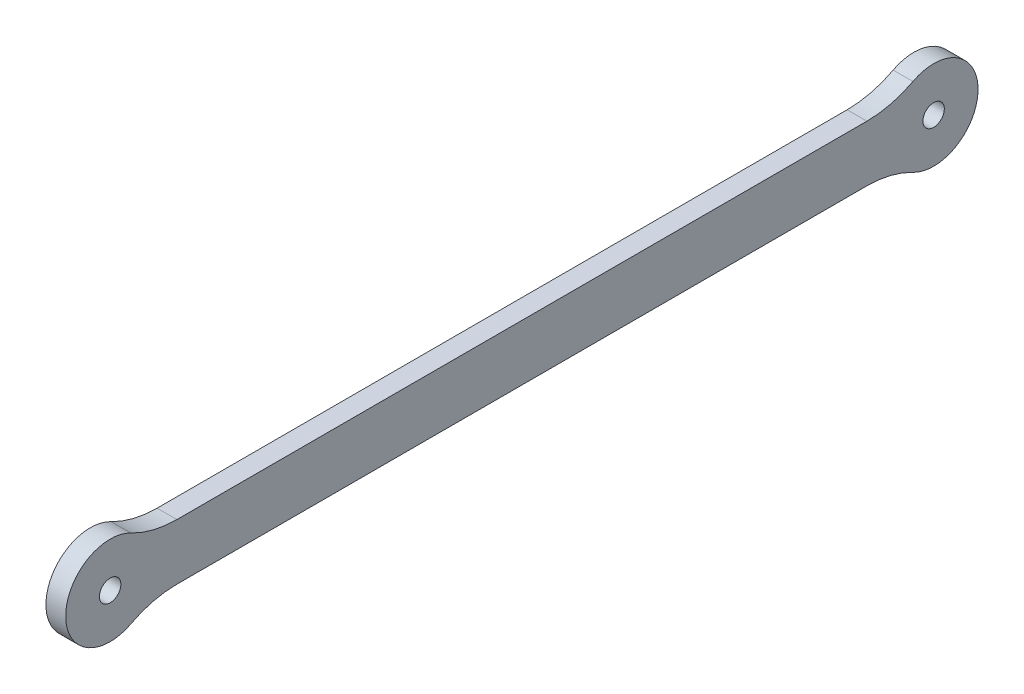
ISO-10303-21;
HEADER;
FILE_DESCRIPTION(('STEP AP214'),'2;1');
FILE_NAME('part.step','',(''),(''),'','','');
FILE_SCHEMA(('AUTOMOTIVE_DESIGN { 1 0 10303 214 1 1 1 1 }'));
ENDSEC;
DATA;
#1=APPLICATION_CONTEXT('core data for automotive mechanical design processes');
#2=APPLICATION_PROTOCOL_DEFINITION('international standard','automotive_design',2000,#1);
#3=PRODUCT_CONTEXT('',#1,'mechanical');
#4=PRODUCT('Part','Part','',(#3));
#5=PRODUCT_RELATED_PRODUCT_CATEGORY('part','',(#4));
#6=PRODUCT_DEFINITION_FORMATION('','',#4);
#7=PRODUCT_DEFINITION_CONTEXT('part definition',#1,'design');
#8=PRODUCT_DEFINITION('design','',#6,#7);
#9=PRODUCT_DEFINITION_SHAPE('','',#8);
#10=(LENGTH_UNIT() NAMED_UNIT(*) SI_UNIT(.MILLI.,.METRE.));
#11=(NAMED_UNIT(*) PLANE_ANGLE_UNIT() SI_UNIT($,.RADIAN.));
#12=(NAMED_UNIT(*) SI_UNIT($,.STERADIAN.) SOLID_ANGLE_UNIT());
#13=UNCERTAINTY_MEASURE_WITH_UNIT(LENGTH_MEASURE(1.E-05),#10,'distance_accuracy_value','');
#14=(GEOMETRIC_REPRESENTATION_CONTEXT(3) GLOBAL_UNCERTAINTY_ASSIGNED_CONTEXT((#13)) GLOBAL_UNIT_ASSIGNED_CONTEXT((#10,
#11,#12)) REPRESENTATION_CONTEXT('',''));
#15=CARTESIAN_POINT('',(0.,0.,0.));
#16=DIRECTION('',(0.,0.,1.));
#17=DIRECTION('',(1.,0.,0.));
#18=AXIS2_PLACEMENT_3D('',#15,#16,#17);
#19=CARTESIAN_POINT('',(-1.5,0.,0.));
#20=DIRECTION('',(1.,0.,0.));
#21=DIRECTION('',(0.,0.,-1.));
#22=AXIS2_PLACEMENT_3D('',#19,#20,#21);
#23=PLANE('',#22);
#24=CARTESIAN_POINT('',(-1.5,0.,-62.5));
#25=DIRECTION('',(-1.,0.,0.));
#26=DIRECTION('',(0.,0.,1.));
#27=AXIS2_PLACEMENT_3D('',#24,#25,#26);
#28=CIRCLE('',#27,1.62500000000001);
#29=CARTESIAN_POINT('',(-1.5,0.,-60.875));
#30=VERTEX_POINT('',#29);
#31=EDGE_CURVE('E140',#30,#30,#28,.F.);
#32=ORIENTED_EDGE('',*,*,#31,.T.);
#33=EDGE_LOOP('',(#32));
#34=FACE_BOUND('',#33,.T.);
#35=CARTESIAN_POINT('',(-1.5,0.,62.5));
#36=DIRECTION('',(-1.,0.,0.));
#37=DIRECTION('',(0.,0.,1.));
#38=AXIS2_PLACEMENT_3D('',#35,#36,#37);
#39=CIRCLE('',#38,1.62500000000001);
#40=CARTESIAN_POINT('',(-1.5,0.,64.125));
#41=VERTEX_POINT('',#40);
#42=EDGE_CURVE('E98',#41,#41,#39,.F.);
#43=ORIENTED_EDGE('',*,*,#42,.T.);
#44=EDGE_LOOP('',(#43));
#45=FACE_BOUND('',#44,.T.);
#46=CARTESIAN_POINT('',(-1.5,19.25,-52.3757716343417));
#47=DIRECTION('',(-1.,0.,0.));
#48=DIRECTION('',(0.,0.,1.));
#49=AXIS2_PLACEMENT_3D('',#46,#47,#48);
#50=CIRCLE('',#49,15.);
#51=CARTESIAN_POINT('',(-1.5,4.25000000000001,-52.3757716343417));
#52=VERTEX_POINT('',#51);
#53=CARTESIAN_POINT('',(-1.5,5.97413793103448,-59.3579980934164));
#54=VERTEX_POINT('',#53);
#55=EDGE_CURVE('E84',#52,#54,#50,.F.);
#56=ORIENTED_EDGE('',*,*,#55,.T.);
#57=CARTESIAN_POINT('',(-1.5,0.,-62.5));
#58=DIRECTION('',(-1.,0.,0.));
#59=DIRECTION('',(0.,0.,1.));
#60=AXIS2_PLACEMENT_3D('',#57,#58,#59);
#61=CIRCLE('',#60,6.74999999999999);
#62=CARTESIAN_POINT('',(-1.5,-5.97413793103448,-59.3579980934164));
#63=VERTEX_POINT('',#62);
#64=EDGE_CURVE('E20',#63,#54,#61,.F.);
#65=ORIENTED_EDGE('',*,*,#64,.F.);
#66=CARTESIAN_POINT('',(-1.5,-19.25,-52.3757716343417));
#67=DIRECTION('',(-1.,0.,0.));
#68=DIRECTION('',(0.,0.,1.));
#69=AXIS2_PLACEMENT_3D('',#66,#67,#68);
#70=CIRCLE('',#69,15.);
#71=CARTESIAN_POINT('',(-1.5,-4.25,-52.3757716343417));
#72=VERTEX_POINT('',#71);
#73=EDGE_CURVE('E82',#63,#72,#70,.F.);
#74=ORIENTED_EDGE('',*,*,#73,.T.);
#75=DIRECTION('',(0.,0.,-1.));
#76=VECTOR('',#75,1.);
#77=CARTESIAN_POINT('',(-1.5,-4.25,0.));
#78=LINE('',#77,#76);
#79=CARTESIAN_POINT('',(-1.5,-4.25000000000001,52.3757716343417));
#80=VERTEX_POINT('',#79);
#81=EDGE_CURVE('E121',#80,#72,#78,.T.);
#82=ORIENTED_EDGE('',*,*,#81,.F.);
#83=CARTESIAN_POINT('',(-1.5,-19.25,52.3757716343417));
#84=DIRECTION('',(-1.,0.,0.));
#85=DIRECTION('',(0.,0.,1.));
#86=AXIS2_PLACEMENT_3D('',#83,#84,#85);
#87=CIRCLE('',#86,15.);
#88=CARTESIAN_POINT('',(-1.5,-5.9741379310345,59.3579980934164));
#89=VERTEX_POINT('',#88);
#90=EDGE_CURVE('E103',#80,#89,#87,.F.);
#91=ORIENTED_EDGE('',*,*,#90,.T.);
#92=CARTESIAN_POINT('',(-1.5,0.,62.5));
#93=DIRECTION('',(-1.,0.,0.));
#94=DIRECTION('',(0.,0.,1.));
#95=AXIS2_PLACEMENT_3D('',#92,#93,#94);
#96=CIRCLE('',#95,6.75);
#97=CARTESIAN_POINT('',(-1.5,5.97413793103448,59.3579980934164));
#98=VERTEX_POINT('',#97);
#99=EDGE_CURVE('E106',#98,#89,#96,.F.);
#100=ORIENTED_EDGE('',*,*,#99,.F.);
#101=CARTESIAN_POINT('',(-1.5,19.25,52.3757716343417));
#102=DIRECTION('',(-1.,0.,0.));
#103=DIRECTION('',(0.,0.,1.));
#104=AXIS2_PLACEMENT_3D('',#101,#102,#103);
#105=CIRCLE('',#104,15.);
#106=CARTESIAN_POINT('',(-1.5,4.25,52.3757716343417));
#107=VERTEX_POINT('',#106);
#108=EDGE_CURVE('E110',#98,#107,#105,.F.);
#109=ORIENTED_EDGE('',*,*,#108,.T.);
#110=DIRECTION('',(0.,0.,-1.));
#111=VECTOR('',#110,1.);
#112=CARTESIAN_POINT('',(-1.5,4.25,0.));
#113=LINE('',#112,#111);
#114=EDGE_CURVE('E114',#107,#52,#113,.T.);
#115=ORIENTED_EDGE('',*,*,#114,.T.);
#116=EDGE_LOOP('',(#56,#65,#74,#82,#91,#100,#109,#115));
#117=FACE_BOUND('',#116,.T.);
#118=ADVANCED_FACE('F17',(#34,#45,#117),#23,.F.);
#119=CARTESIAN_POINT('',(1.5,0.,-62.5));
#120=DIRECTION('',(-1.,0.,0.));
#121=DIRECTION('',(0.,0.,1.));
#122=AXIS2_PLACEMENT_3D('',#119,#120,#121);
#123=CYLINDRICAL_SURFACE('',#122,6.74999999999999);
#124=CARTESIAN_POINT('',(1.5,0.,-62.5));
#125=DIRECTION('',(-1.,0.,0.));
#126=DIRECTION('',(0.,0.,1.));
#127=AXIS2_PLACEMENT_3D('',#124,#125,#126);
#128=CIRCLE('',#127,6.74999999999999);
#129=CARTESIAN_POINT('',(1.5,-5.97413793103448,-59.3579980934164));
#130=VERTEX_POINT('',#129);
#131=CARTESIAN_POINT('',(1.5,5.97413793103448,-59.3579980934164));
#132=VERTEX_POINT('',#131);
#133=EDGE_CURVE('E91',#130,#132,#128,.F.);
#134=ORIENTED_EDGE('',*,*,#133,.F.);
#135=DIRECTION('',(-1.,0.,0.));
#136=VECTOR('',#135,1.);
#137=CARTESIAN_POINT('',(1.5,-5.97413793103448,-59.3579980934164));
#138=LINE('',#137,#136);
#139=EDGE_CURVE('E88',#130,#63,#138,.T.);
#140=ORIENTED_EDGE('',*,*,#139,.T.);
#141=ORIENTED_EDGE('',*,*,#64,.T.);
#142=DIRECTION('',(-1.,0.,0.));
#143=VECTOR('',#142,1.);
#144=CARTESIAN_POINT('',(1.5,5.97413793103448,-59.3579980934164));
#145=LINE('',#144,#143);
#146=EDGE_CURVE('E113',#54,#132,#145,.F.);
#147=ORIENTED_EDGE('',*,*,#146,.T.);
#148=EDGE_LOOP('',(#134,#140,#141,#147));
#149=FACE_BOUND('',#148,.T.);
#150=ADVANCED_FACE('F89',(#149),#123,.T.);
#151=CARTESIAN_POINT('',(1.5,19.25,-52.3757716343417));
#152=DIRECTION('',(-1.,0.,0.));
#153=DIRECTION('',(0.,0.,1.));
#154=AXIS2_PLACEMENT_3D('',#151,#152,#153);
#155=CYLINDRICAL_SURFACE('',#154,15.);
#156=ORIENTED_EDGE('',*,*,#146,.F.);
#157=ORIENTED_EDGE('',*,*,#55,.F.);
#158=DIRECTION('',(1.,0.,0.));
#159=VECTOR('',#158,1.);
#160=CARTESIAN_POINT('',(1.5,4.25000000000001,-52.3757716343417));
#161=LINE('',#160,#159);
#162=CARTESIAN_POINT('',(1.5,4.25000000000001,-52.3757716343417));
#163=VERTEX_POINT('',#162);
#164=EDGE_CURVE('E112',#52,#163,#161,.T.);
#165=ORIENTED_EDGE('',*,*,#164,.T.);
#166=CARTESIAN_POINT('',(1.5,19.25,-52.3757716343417));
#167=DIRECTION('',(-1.,0.,0.));
#168=DIRECTION('',(0.,0.,1.));
#169=AXIS2_PLACEMENT_3D('',#166,#167,#168);
#170=CIRCLE('',#169,15.);
#171=EDGE_CURVE('E137',#132,#163,#170,.T.);
#172=ORIENTED_EDGE('',*,*,#171,.F.);
#173=EDGE_LOOP('',(#156,#157,#165,#172));
#174=FACE_BOUND('',#173,.T.);
#175=ADVANCED_FACE('F195',(#174),#155,.F.);
#176=CARTESIAN_POINT('',(1.5,4.25,0.));
#177=DIRECTION('',(0.,-1.,0.));
#178=DIRECTION('',(0.,0.,-1.));
#179=AXIS2_PLACEMENT_3D('',#176,#177,#178);
#180=PLANE('',#179);
#181=ORIENTED_EDGE('',*,*,#164,.F.);
#182=ORIENTED_EDGE('',*,*,#114,.F.);
#183=DIRECTION('',(-1.,0.,0.));
#184=VECTOR('',#183,1.);
#185=CARTESIAN_POINT('',(1.5,4.25,52.3757716343417));
#186=LINE('',#185,#184);
#187=CARTESIAN_POINT('',(1.5,4.25,52.3757716343417));
#188=VERTEX_POINT('',#187);
#189=EDGE_CURVE('E111',#107,#188,#186,.F.);
#190=ORIENTED_EDGE('',*,*,#189,.T.);
#191=DIRECTION('',(0.,0.,-1.));
#192=VECTOR('',#191,1.);
#193=CARTESIAN_POINT('',(1.5,4.25000000000001,0.));
#194=LINE('',#193,#192);
#195=EDGE_CURVE('E136',#163,#188,#194,.F.);
#196=ORIENTED_EDGE('',*,*,#195,.F.);
#197=EDGE_LOOP('',(#181,#182,#190,#196));
#198=FACE_BOUND('',#197,.T.);
#199=ADVANCED_FACE('F189',(#198),#180,.F.);
#200=CARTESIAN_POINT('',(1.5,19.25,52.3757716343417));
#201=DIRECTION('',(-1.,0.,0.));
#202=DIRECTION('',(0.,0.,1.));
#203=AXIS2_PLACEMENT_3D('',#200,#201,#202);
#204=CYLINDRICAL_SURFACE('',#203,15.);
#205=ORIENTED_EDGE('',*,*,#189,.F.);
#206=ORIENTED_EDGE('',*,*,#108,.F.);
#207=DIRECTION('',(-1.,0.,0.));
#208=VECTOR('',#207,1.);
#209=CARTESIAN_POINT('',(1.5,5.97413793103448,59.3579980934164));
#210=LINE('',#209,#208);
#211=CARTESIAN_POINT('',(1.5,5.97413793103448,59.3579980934164));
#212=VERTEX_POINT('',#211);
#213=EDGE_CURVE('E109',#212,#98,#210,.T.);
#214=ORIENTED_EDGE('',*,*,#213,.F.);
#215=CARTESIAN_POINT('',(1.5,19.25,52.3757716343417));
#216=DIRECTION('',(-1.,0.,0.));
#217=DIRECTION('',(0.,0.,1.));
#218=AXIS2_PLACEMENT_3D('',#215,#216,#217);
#219=CIRCLE('',#218,15.);
#220=EDGE_CURVE('E133',#188,#212,#219,.T.);
#221=ORIENTED_EDGE('',*,*,#220,.F.);
#222=EDGE_LOOP('',(#205,#206,#214,#221));
#223=FACE_BOUND('',#222,.T.);
#224=ADVANCED_FACE('F192',(#223),#204,.F.);
#225=CARTESIAN_POINT('',(1.5,0.,62.5));
#226=DIRECTION('',(-1.,0.,0.));
#227=DIRECTION('',(0.,0.,1.));
#228=AXIS2_PLACEMENT_3D('',#225,#226,#227);
#229=CYLINDRICAL_SURFACE('',#228,6.75);
#230=ORIENTED_EDGE('',*,*,#99,.T.);
#231=DIRECTION('',(-1.,0.,0.));
#232=VECTOR('',#231,1.);
#233=CARTESIAN_POINT('',(1.5,-5.9741379310345,59.3579980934164));
#234=LINE('',#233,#232);
#235=CARTESIAN_POINT('',(1.5,-5.9741379310345,59.3579980934164));
#236=VERTEX_POINT('',#235);
#237=EDGE_CURVE('E105',#89,#236,#234,.F.);
#238=ORIENTED_EDGE('',*,*,#237,.T.);
#239=CARTESIAN_POINT('',(1.5,0.,62.5));
#240=DIRECTION('',(-1.,0.,0.));
#241=DIRECTION('',(0.,0.,1.));
#242=AXIS2_PLACEMENT_3D('',#239,#240,#241);
#243=CIRCLE('',#242,6.75);
#244=EDGE_CURVE('E131',#212,#236,#243,.F.);
#245=ORIENTED_EDGE('',*,*,#244,.F.);
#246=ORIENTED_EDGE('',*,*,#213,.T.);
#247=EDGE_LOOP('',(#230,#238,#245,#246));
#248=FACE_BOUND('',#247,.T.);
#249=ADVANCED_FACE('F206',(#248),#229,.T.);
#250=CARTESIAN_POINT('',(1.5,-19.25,52.3757716343417));
#251=DIRECTION('',(-1.,0.,0.));
#252=DIRECTION('',(0.,0.,1.));
#253=AXIS2_PLACEMENT_3D('',#250,#251,#252);
#254=CYLINDRICAL_SURFACE('',#253,15.);
#255=ORIENTED_EDGE('',*,*,#237,.F.);
#256=ORIENTED_EDGE('',*,*,#90,.F.);
#257=DIRECTION('',(1.,0.,0.));
#258=VECTOR('',#257,1.);
#259=CARTESIAN_POINT('',(1.5,-4.25000000000001,52.3757716343417));
#260=LINE('',#259,#258);
#261=CARTESIAN_POINT('',(1.5,-4.25000000000001,52.3757716343417));
#262=VERTEX_POINT('',#261);
#263=EDGE_CURVE('E94',#262,#80,#260,.F.);
#264=ORIENTED_EDGE('',*,*,#263,.F.);
#265=CARTESIAN_POINT('',(1.5,-19.25,52.3757716343417));
#266=DIRECTION('',(-1.,0.,0.));
#267=DIRECTION('',(0.,0.,1.));
#268=AXIS2_PLACEMENT_3D('',#265,#266,#267);
#269=CIRCLE('',#268,15.);
#270=EDGE_CURVE('E128',#236,#262,#269,.T.);
#271=ORIENTED_EDGE('',*,*,#270,.F.);
#272=EDGE_LOOP('',(#255,#256,#264,#271));
#273=FACE_BOUND('',#272,.T.);
#274=ADVANCED_FACE('F209',(#273),#254,.F.);
#275=CARTESIAN_POINT('',(1.5,-4.25,0.));
#276=DIRECTION('',(0.,-1.,0.));
#277=DIRECTION('',(0.,0.,-1.));
#278=AXIS2_PLACEMENT_3D('',#275,#276,#277);
#279=PLANE('',#278);
#280=DIRECTION('',(0.,0.,-1.));
#281=VECTOR('',#280,1.);
#282=CARTESIAN_POINT('',(1.5,-4.25000000000001,0.));
#283=LINE('',#282,#281);
#284=CARTESIAN_POINT('',(1.5,-4.25,-52.3757716343417));
#285=VERTEX_POINT('',#284);
#286=EDGE_CURVE('E127',#262,#285,#283,.T.);
#287=ORIENTED_EDGE('',*,*,#286,.F.);
#288=ORIENTED_EDGE('',*,*,#263,.T.);
#289=ORIENTED_EDGE('',*,*,#81,.T.);
#290=DIRECTION('',(-1.,0.,0.));
#291=VECTOR('',#290,1.);
#292=CARTESIAN_POINT('',(1.5,-4.25,-52.3757716343417));
#293=LINE('',#292,#291);
#294=EDGE_CURVE('E35',#72,#285,#293,.F.);
#295=ORIENTED_EDGE('',*,*,#294,.T.);
#296=EDGE_LOOP('',(#287,#288,#289,#295));
#297=FACE_BOUND('',#296,.T.);
#298=ADVANCED_FACE('F161',(#297),#279,.T.);
#299=CARTESIAN_POINT('',(1.5,-19.25,-52.3757716343417));
#300=DIRECTION('',(-1.,0.,0.));
#301=DIRECTION('',(0.,0.,1.));
#302=AXIS2_PLACEMENT_3D('',#299,#300,#301);
#303=CYLINDRICAL_SURFACE('',#302,15.);
#304=ORIENTED_EDGE('',*,*,#294,.F.);
#305=ORIENTED_EDGE('',*,*,#73,.F.);
#306=ORIENTED_EDGE('',*,*,#139,.F.);
#307=CARTESIAN_POINT('',(1.5,-19.25,-52.3757716343417));
#308=DIRECTION('',(-1.,0.,0.));
#309=DIRECTION('',(0.,0.,1.));
#310=AXIS2_PLACEMENT_3D('',#307,#308,#309);
#311=CIRCLE('',#310,15.);
#312=EDGE_CURVE('E125',#285,#130,#311,.T.);
#313=ORIENTED_EDGE('',*,*,#312,.F.);
#314=EDGE_LOOP('',(#304,#305,#306,#313));
#315=FACE_BOUND('',#314,.T.);
#316=ADVANCED_FACE('F96',(#315),#303,.F.);
#317=CARTESIAN_POINT('',(1.5,0.,62.5));
#318=DIRECTION('',(-1.,0.,0.));
#319=DIRECTION('',(0.,0.,1.));
#320=AXIS2_PLACEMENT_3D('',#317,#318,#319);
#321=CYLINDRICAL_SURFACE('',#320,1.62500000000001);
#322=CARTESIAN_POINT('',(1.5,0.,62.5));
#323=DIRECTION('',(-1.,0.,0.));
#324=DIRECTION('',(0.,0.,1.));
#325=AXIS2_PLACEMENT_3D('',#322,#323,#324);
#326=CIRCLE('',#325,1.62500000000001);
#327=CARTESIAN_POINT('',(1.5,0.,64.125));
#328=VERTEX_POINT('',#327);
#329=EDGE_CURVE('E26',#328,#328,#326,.T.);
#330=ORIENTED_EDGE('',*,*,#329,.F.);
#331=EDGE_LOOP('',(#330));
#332=FACE_BOUND('',#331,.T.);
#333=ORIENTED_EDGE('',*,*,#42,.F.);
#334=EDGE_LOOP('',(#333));
#335=FACE_BOUND('',#334,.T.);
#336=ADVANCED_FACE('F148',(#332,#335),#321,.F.);
#337=CARTESIAN_POINT('',(1.5,0.,-62.5));
#338=DIRECTION('',(-1.,0.,0.));
#339=DIRECTION('',(0.,0.,1.));
#340=AXIS2_PLACEMENT_3D('',#337,#338,#339);
#341=CYLINDRICAL_SURFACE('',#340,1.62500000000001);
#342=CARTESIAN_POINT('',(1.5,0.,-62.5));
#343=DIRECTION('',(-1.,0.,0.));
#344=DIRECTION('',(0.,0.,1.));
#345=AXIS2_PLACEMENT_3D('',#342,#343,#344);
#346=CIRCLE('',#345,1.62500000000001);
#347=CARTESIAN_POINT('',(1.5,0.,-60.875));
#348=VERTEX_POINT('',#347);
#349=EDGE_CURVE('E11',#348,#348,#346,.T.);
#350=ORIENTED_EDGE('',*,*,#349,.F.);
#351=EDGE_LOOP('',(#350));
#352=FACE_BOUND('',#351,.T.);
#353=ORIENTED_EDGE('',*,*,#31,.F.);
#354=EDGE_LOOP('',(#353));
#355=FACE_BOUND('',#354,.T.);
#356=ADVANCED_FACE('F150',(#352,#355),#341,.F.);
#357=CARTESIAN_POINT('',(1.5,0.,0.));
#358=DIRECTION('',(1.,0.,0.));
#359=DIRECTION('',(0.,0.,-1.));
#360=AXIS2_PLACEMENT_3D('',#357,#358,#359);
#361=PLANE('',#360);
#362=ORIENTED_EDGE('',*,*,#349,.T.);
#363=EDGE_LOOP('',(#362));
#364=FACE_BOUND('',#363,.T.);
#365=ORIENTED_EDGE('',*,*,#329,.T.);
#366=EDGE_LOOP('',(#365));
#367=FACE_BOUND('',#366,.T.);
#368=ORIENTED_EDGE('',*,*,#286,.T.);
#369=ORIENTED_EDGE('',*,*,#312,.T.);
#370=ORIENTED_EDGE('',*,*,#133,.T.);
#371=ORIENTED_EDGE('',*,*,#171,.T.);
#372=ORIENTED_EDGE('',*,*,#195,.T.);
#373=ORIENTED_EDGE('',*,*,#220,.T.);
#374=ORIENTED_EDGE('',*,*,#244,.T.);
#375=ORIENTED_EDGE('',*,*,#270,.T.);
#376=EDGE_LOOP('',(#368,#369,#370,#371,#372,#373,#374,#375));
#377=FACE_BOUND('',#376,.T.);
#378=ADVANCED_FACE('F158',(#364,#367,#377),#361,.T.);
#379=CLOSED_SHELL('',(#118,#150,#175,#199,#224,#249,#274,#298,#316,#336,#356,#378));
#380=MANIFOLD_SOLID_BREP('B1',#379);
#381=ADVANCED_BREP_SHAPE_REPRESENTATION('',(#18,#380),#14);
#382=SHAPE_DEFINITION_REPRESENTATION(#9,#381);
ENDSEC;
END-ISO-10303-21;
